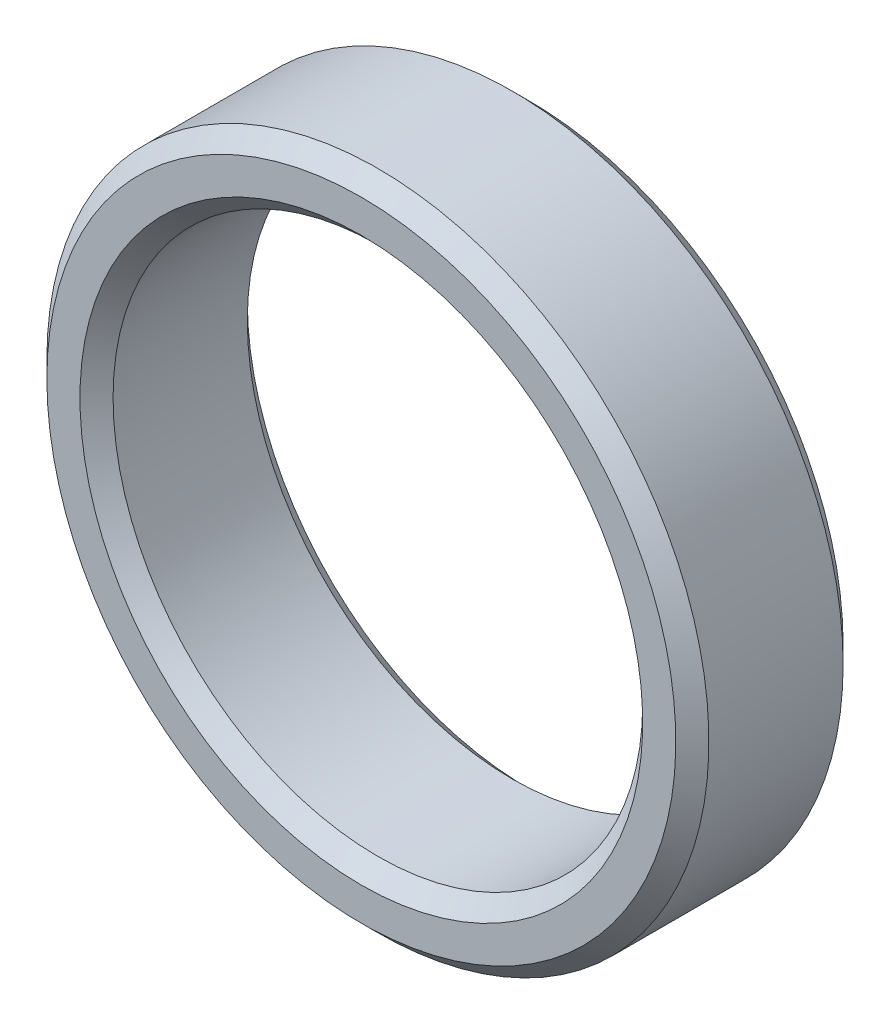
ISO-10303-21;
HEADER;
FILE_DESCRIPTION(('STEP AP214'),'2;1');
FILE_NAME('part.step','',(''),(''),'','','');
FILE_SCHEMA(('AUTOMOTIVE_DESIGN { 1 0 10303 214 1 1 1 1 }'));
ENDSEC;
DATA;
#1=APPLICATION_CONTEXT('core data for automotive mechanical design processes');
#2=APPLICATION_PROTOCOL_DEFINITION('international standard','automotive_design',2000,#1);
#3=PRODUCT_CONTEXT('',#1,'mechanical');
#4=PRODUCT('Part','Part','',(#3));
#5=PRODUCT_RELATED_PRODUCT_CATEGORY('part','',(#4));
#6=PRODUCT_DEFINITION_FORMATION('','',#4);
#7=PRODUCT_DEFINITION_CONTEXT('part definition',#1,'design');
#8=PRODUCT_DEFINITION('design','',#6,#7);
#9=PRODUCT_DEFINITION_SHAPE('','',#8);
#10=(LENGTH_UNIT() NAMED_UNIT(*) SI_UNIT(.MILLI.,.METRE.));
#11=(NAMED_UNIT(*) PLANE_ANGLE_UNIT() SI_UNIT($,.RADIAN.));
#12=(NAMED_UNIT(*) SI_UNIT($,.STERADIAN.) SOLID_ANGLE_UNIT());
#13=UNCERTAINTY_MEASURE_WITH_UNIT(LENGTH_MEASURE(1.E-05),#10,'distance_accuracy_value','');
#14=(GEOMETRIC_REPRESENTATION_CONTEXT(3) GLOBAL_UNCERTAINTY_ASSIGNED_CONTEXT((#13)) GLOBAL_UNIT_ASSIGNED_CONTEXT((#10,
#11,#12)) REPRESENTATION_CONTEXT('',''));
#15=CARTESIAN_POINT('',(0.,0.,0.));
#16=DIRECTION('',(0.,0.,1.));
#17=DIRECTION('',(1.,0.,0.));
#18=AXIS2_PLACEMENT_3D('',#15,#16,#17);
#19=CARTESIAN_POINT('',(0.,0.,0.));
#20=DIRECTION('',(0.,0.,1.));
#21=DIRECTION('',(1.,0.,0.));
#22=AXIS2_PLACEMENT_3D('',#19,#20,#21);
#23=PLANE('',#22);
#24=CARTESIAN_POINT('',(0.,0.,0.));
#25=DIRECTION('',(0.,0.,1.));
#26=DIRECTION('',(1.,0.,0.));
#27=AXIS2_PLACEMENT_3D('',#24,#25,#26);
#28=CIRCLE('',#27,13.49375);
#29=CARTESIAN_POINT('',(13.49375,0.,0.));
#30=VERTEX_POINT('',#29);
#31=EDGE_CURVE('E58',#30,#30,#28,.T.);
#32=ORIENTED_EDGE('',*,*,#31,.T.);
#33=EDGE_LOOP('',(#32));
#34=FACE_BOUND('',#33,.T.);
#35=CARTESIAN_POINT('',(0.,0.,0.));
#36=DIRECTION('',(0.,0.,1.));
#37=DIRECTION('',(1.,0.,0.));
#38=AXIS2_PLACEMENT_3D('',#35,#36,#37);
#39=CIRCLE('',#38,15.08125);
#40=CARTESIAN_POINT('',(15.08125,0.,0.));
#41=VERTEX_POINT('',#40);
#42=EDGE_CURVE('E61',#41,#41,#39,.F.);
#43=ORIENTED_EDGE('',*,*,#42,.T.);
#44=EDGE_LOOP('',(#43));
#45=FACE_BOUND('',#44,.T.);
#46=ADVANCED_FACE('F32',(#34,#45),#23,.F.);
#47=CARTESIAN_POINT('',(0.,0.,52.9262806053458));
#48=DIRECTION('',(0.,0.,-1.));
#49=DIRECTION('',(-1.,0.,0.));
#50=AXIS2_PLACEMENT_3D('',#47,#48,#49);
#51=CYLINDRICAL_SURFACE('',#50,15.875);
#52=CARTESIAN_POINT('',(0.,0.,0.793750000000017));
#53=DIRECTION('',(0.,0.,1.));
#54=DIRECTION('',(1.,0.,0.));
#55=AXIS2_PLACEMENT_3D('',#52,#53,#54);
#56=CIRCLE('',#55,15.875);
#57=CARTESIAN_POINT('',(15.875,0.,0.793750000000017));
#58=VERTEX_POINT('',#57);
#59=EDGE_CURVE('E43',#58,#58,#56,.T.);
#60=ORIENTED_EDGE('',*,*,#59,.T.);
#61=EDGE_LOOP('',(#60));
#62=FACE_BOUND('',#61,.T.);
#63=CARTESIAN_POINT('',(0.,0.,7.23125000000006));
#64=DIRECTION('',(0.,0.,-1.));
#65=DIRECTION('',(-1.,0.,0.));
#66=AXIS2_PLACEMENT_3D('',#63,#64,#65);
#67=CIRCLE('',#66,15.875);
#68=CARTESIAN_POINT('',(-15.875,0.,7.23125000000006));
#69=VERTEX_POINT('',#68);
#70=EDGE_CURVE('E47',#69,#69,#67,.T.);
#71=ORIENTED_EDGE('',*,*,#70,.T.);
#72=EDGE_LOOP('',(#71));
#73=FACE_BOUND('',#72,.T.);
#74=ADVANCED_FACE('F74',(#62,#73),#51,.T.);
#75=CARTESIAN_POINT('',(0.,0.,52.9262806053458));
#76=DIRECTION('',(0.,0.,-1.));
#77=DIRECTION('',(-1.,0.,0.));
#78=AXIS2_PLACEMENT_3D('',#75,#76,#77);
#79=CYLINDRICAL_SURFACE('',#78,12.7);
#80=CARTESIAN_POINT('',(0.,0.,0.793750000000003));
#81=DIRECTION('',(0.,0.,1.));
#82=DIRECTION('',(1.,0.,0.));
#83=AXIS2_PLACEMENT_3D('',#80,#81,#82);
#84=CIRCLE('',#83,12.7);
#85=CARTESIAN_POINT('',(12.7,0.,0.793750000000003));
#86=VERTEX_POINT('',#85);
#87=EDGE_CURVE('E52',#86,#86,#84,.F.);
#88=ORIENTED_EDGE('',*,*,#87,.T.);
#89=EDGE_LOOP('',(#88));
#90=FACE_BOUND('',#89,.T.);
#91=CARTESIAN_POINT('',(0.,0.,7.23125000000011));
#92=DIRECTION('',(0.,0.,-1.));
#93=DIRECTION('',(-1.,0.,0.));
#94=AXIS2_PLACEMENT_3D('',#91,#92,#93);
#95=CIRCLE('',#94,12.7);
#96=CARTESIAN_POINT('',(-12.7,0.,7.23125000000011));
#97=VERTEX_POINT('',#96);
#98=EDGE_CURVE('E55',#97,#97,#95,.F.);
#99=ORIENTED_EDGE('',*,*,#98,.T.);
#100=EDGE_LOOP('',(#99));
#101=FACE_BOUND('',#100,.T.);
#102=ADVANCED_FACE('F77',(#90,#101),#79,.F.);
#103=CARTESIAN_POINT('',(0.,-2.47475279674218E-13,8.02500000000007));
#104=DIRECTION('',(0.,0.,-1.));
#105=DIRECTION('',(0.0986735833438265,0.995119854062861,0.));
#106=AXIS2_PLACEMENT_3D('',#103,#104,#105);
#107=PLANE('',#106);
#108=CARTESIAN_POINT('',(0.,0.,8.02500000000007));
#109=DIRECTION('',(0.,0.,-1.));
#110=DIRECTION('',(0.,1.,0.));
#111=AXIS2_PLACEMENT_3D('',#108,#109,#110);
#112=CIRCLE('',#111,15.08125);
#113=CARTESIAN_POINT('',(0.,15.08125,8.02500000000008));
#114=VERTEX_POINT('',#113);
#115=EDGE_CURVE('E10',#114,#114,#112,.F.);
#116=ORIENTED_EDGE('',*,*,#115,.T.);
#117=EDGE_LOOP('',(#116));
#118=FACE_BOUND('',#117,.T.);
#119=CARTESIAN_POINT('',(0.,0.,8.02500000000007));
#120=DIRECTION('',(0.,0.,-1.));
#121=DIRECTION('',(0.,1.,0.));
#122=AXIS2_PLACEMENT_3D('',#119,#120,#121);
#123=CIRCLE('',#122,13.49375);
#124=CARTESIAN_POINT('',(0.,13.49375,8.02500000000007));
#125=VERTEX_POINT('',#124);
#126=EDGE_CURVE('E39',#125,#125,#123,.T.);
#127=ORIENTED_EDGE('',*,*,#126,.T.);
#128=EDGE_LOOP('',(#127));
#129=FACE_BOUND('',#128,.T.);
#130=ADVANCED_FACE('F95',(#118,#129),#107,.F.);
#131=CARTESIAN_POINT('',(0.,0.,0.));
#132=DIRECTION('',(0.,0.,-1.));
#133=DIRECTION('',(-1.,0.,0.));
#134=AXIS2_PLACEMENT_3D('',#131,#132,#133);
#135=CONICAL_SURFACE('',#134,13.49375,0.785398163397447);
#136=ORIENTED_EDGE('',*,*,#87,.F.);
#137=EDGE_LOOP('',(#136));
#138=FACE_BOUND('',#137,.T.);
#139=ORIENTED_EDGE('',*,*,#31,.F.);
#140=EDGE_LOOP('',(#139));
#141=FACE_BOUND('',#140,.T.);
#142=ADVANCED_FACE('F70',(#138,#141),#135,.F.);
#143=CARTESIAN_POINT('',(0.,0.,0.793750000000017));
#144=DIRECTION('',(0.,0.,1.));
#145=DIRECTION('',(1.,0.,0.));
#146=AXIS2_PLACEMENT_3D('',#143,#144,#145);
#147=CONICAL_SURFACE('',#146,15.875,0.78539816339745);
#148=ORIENTED_EDGE('',*,*,#42,.F.);
#149=EDGE_LOOP('',(#148));
#150=FACE_BOUND('',#149,.T.);
#151=ORIENTED_EDGE('',*,*,#59,.F.);
#152=EDGE_LOOP('',(#151));
#153=FACE_BOUND('',#152,.T.);
#154=ADVANCED_FACE('F66',(#150,#153),#147,.T.);
#155=CARTESIAN_POINT('',(0.,0.,7.23125000000006));
#156=DIRECTION('',(0.,0.,-1.));
#157=DIRECTION('',(-1.,0.,0.));
#158=AXIS2_PLACEMENT_3D('',#155,#156,#157);
#159=CONICAL_SURFACE('',#158,15.875,0.785398163397449);
#160=ORIENTED_EDGE('',*,*,#115,.F.);
#161=EDGE_LOOP('',(#160));
#162=FACE_BOUND('',#161,.T.);
#163=ORIENTED_EDGE('',*,*,#70,.F.);
#164=EDGE_LOOP('',(#163));
#165=FACE_BOUND('',#164,.T.);
#166=ADVANCED_FACE('F69',(#162,#165),#159,.T.);
#167=CARTESIAN_POINT('',(0.,0.,8.02500000000007));
#168=DIRECTION('',(0.,0.,1.));
#169=DIRECTION('',(1.,0.,0.));
#170=AXIS2_PLACEMENT_3D('',#167,#168,#169);
#171=CONICAL_SURFACE('',#170,13.49375,0.78539816339745);
#172=ORIENTED_EDGE('',*,*,#98,.F.);
#173=EDGE_LOOP('',(#172));
#174=FACE_BOUND('',#173,.T.);
#175=ORIENTED_EDGE('',*,*,#126,.F.);
#176=EDGE_LOOP('',(#175));
#177=FACE_BOUND('',#176,.T.);
#178=ADVANCED_FACE('F34',(#174,#177),#171,.F.);
#179=CLOSED_SHELL('',(#46,#74,#102,#130,#142,#154,#166,#178));
#180=MANIFOLD_SOLID_BREP('B2',#179);
#181=ADVANCED_BREP_SHAPE_REPRESENTATION('',(#18,#180),#14);
#182=SHAPE_DEFINITION_REPRESENTATION(#9,#181);
ENDSEC;
END-ISO-10303-21;
